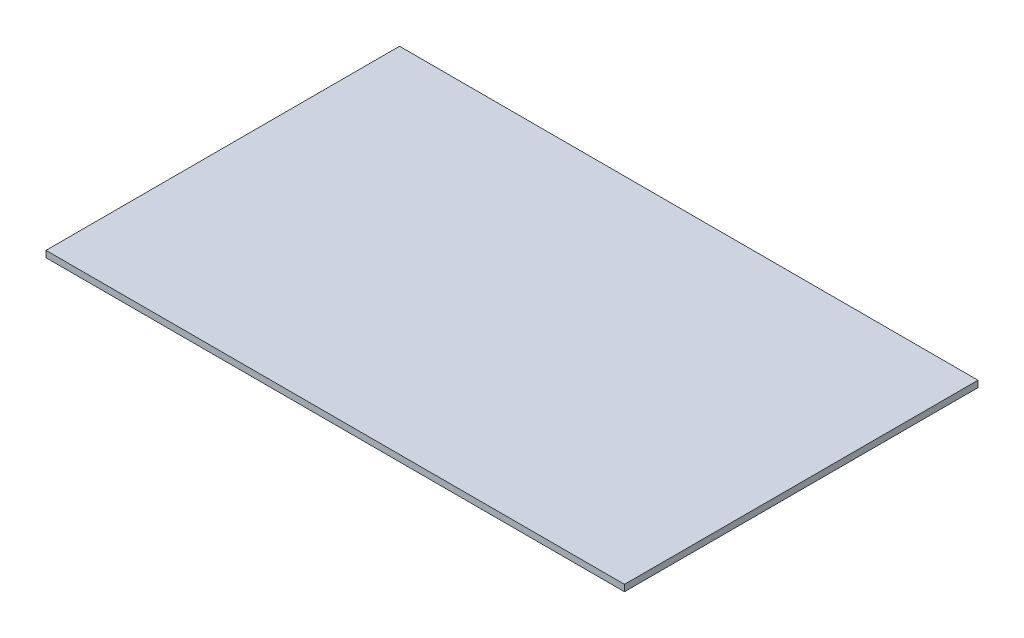
ISO-10303-21;
HEADER;
FILE_DESCRIPTION(('STEP AP214'),'2;1');
FILE_NAME('part.step','',(''),(''),'','','');
FILE_SCHEMA(('AUTOMOTIVE_DESIGN { 1 0 10303 214 1 1 1 1 }'));
ENDSEC;
DATA;
#1=APPLICATION_CONTEXT('core data for automotive mechanical design processes');
#2=APPLICATION_PROTOCOL_DEFINITION('international standard','automotive_design',2000,#1);
#3=PRODUCT_CONTEXT('',#1,'mechanical');
#4=PRODUCT('Part','Part','',(#3));
#5=PRODUCT_RELATED_PRODUCT_CATEGORY('part','',(#4));
#6=PRODUCT_DEFINITION_FORMATION('','',#4);
#7=PRODUCT_DEFINITION_CONTEXT('part definition',#1,'design');
#8=PRODUCT_DEFINITION('design','',#6,#7);
#9=PRODUCT_DEFINITION_SHAPE('','',#8);
#10=(LENGTH_UNIT() NAMED_UNIT(*) SI_UNIT(.MILLI.,.METRE.));
#11=(NAMED_UNIT(*) PLANE_ANGLE_UNIT() SI_UNIT($,.RADIAN.));
#12=(NAMED_UNIT(*) SI_UNIT($,.STERADIAN.) SOLID_ANGLE_UNIT());
#13=UNCERTAINTY_MEASURE_WITH_UNIT(LENGTH_MEASURE(1.E-05),#10,'distance_accuracy_value','');
#14=(GEOMETRIC_REPRESENTATION_CONTEXT(3) GLOBAL_UNCERTAINTY_ASSIGNED_CONTEXT((#13)) GLOBAL_UNIT_ASSIGNED_CONTEXT((#10,
#11,#12)) REPRESENTATION_CONTEXT('',''));
#15=CARTESIAN_POINT('',(0.,0.,0.));
#16=DIRECTION('',(0.,0.,1.));
#17=DIRECTION('',(1.,0.,0.));
#18=AXIS2_PLACEMENT_3D('',#15,#16,#17);
#19=CARTESIAN_POINT('',(0.,1.,0.));
#20=DIRECTION('',(1.,0.,0.));
#21=DIRECTION('',(0.,0.,-1.));
#22=AXIS2_PLACEMENT_3D('',#19,#20,#21);
#23=PLANE('',#22);
#24=DIRECTION('',(0.,0.,1.));
#25=VECTOR('',#24,1.);
#26=CARTESIAN_POINT('',(0.,0.,0.));
#27=LINE('',#26,#25);
#28=CARTESIAN_POINT('',(0.,0.,-55.));
#29=VERTEX_POINT('',#28);
#30=CARTESIAN_POINT('',(0.,0.,0.));
#31=VERTEX_POINT('',#30);
#32=EDGE_CURVE('E96',#29,#31,#27,.T.);
#33=ORIENTED_EDGE('',*,*,#32,.T.);
#34=DIRECTION('',(0.,-1.,0.));
#35=VECTOR('',#34,1.);
#36=CARTESIAN_POINT('',(0.,1.,0.));
#37=LINE('',#36,#35);
#38=CARTESIAN_POINT('',(0.,1.,0.));
#39=VERTEX_POINT('',#38);
#40=EDGE_CURVE('E11',#39,#31,#37,.T.);
#41=ORIENTED_EDGE('',*,*,#40,.F.);
#42=DIRECTION('',(0.,0.,1.));
#43=VECTOR('',#42,1.);
#44=CARTESIAN_POINT('',(0.,1.,0.));
#45=LINE('',#44,#43);
#46=CARTESIAN_POINT('',(0.,1.,-55.));
#47=VERTEX_POINT('',#46);
#48=EDGE_CURVE('E84',#47,#39,#45,.T.);
#49=ORIENTED_EDGE('',*,*,#48,.F.);
#50=DIRECTION('',(0.,-1.,0.));
#51=VECTOR('',#50,1.);
#52=CARTESIAN_POINT('',(0.,1.,-55.));
#53=LINE('',#52,#51);
#54=EDGE_CURVE('E92',#47,#29,#53,.T.);
#55=ORIENTED_EDGE('',*,*,#54,.T.);
#56=EDGE_LOOP('',(#33,#41,#49,#55));
#57=FACE_BOUND('',#56,.T.);
#58=ADVANCED_FACE('F33',(#57),#23,.F.);
#59=CARTESIAN_POINT('',(0.,1.,0.));
#60=DIRECTION('',(0.,0.,-1.));
#61=DIRECTION('',(-1.,0.,0.));
#62=AXIS2_PLACEMENT_3D('',#59,#60,#61);
#63=PLANE('',#62);
#64=DIRECTION('',(1.,0.,0.));
#65=VECTOR('',#64,1.);
#66=CARTESIAN_POINT('',(0.,0.,0.));
#67=LINE('',#66,#65);
#68=CARTESIAN_POINT('',(90.,0.,0.));
#69=VERTEX_POINT('',#68);
#70=EDGE_CURVE('E88',#31,#69,#67,.T.);
#71=ORIENTED_EDGE('',*,*,#70,.T.);
#72=DIRECTION('',(0.,-1.,0.));
#73=VECTOR('',#72,1.);
#74=CARTESIAN_POINT('',(90.,1.,0.));
#75=LINE('',#74,#73);
#76=CARTESIAN_POINT('',(90.,1.,0.));
#77=VERTEX_POINT('',#76);
#78=EDGE_CURVE('E41',#77,#69,#75,.T.);
#79=ORIENTED_EDGE('',*,*,#78,.F.);
#80=DIRECTION('',(1.,0.,0.));
#81=VECTOR('',#80,1.);
#82=CARTESIAN_POINT('',(0.,1.,0.));
#83=LINE('',#82,#81);
#84=EDGE_CURVE('E79',#39,#77,#83,.T.);
#85=ORIENTED_EDGE('',*,*,#84,.F.);
#86=ORIENTED_EDGE('',*,*,#40,.T.);
#87=EDGE_LOOP('',(#71,#79,#85,#86));
#88=FACE_BOUND('',#87,.T.);
#89=ADVANCED_FACE('F87',(#88),#63,.F.);
#90=CARTESIAN_POINT('',(90.,1.,0.));
#91=DIRECTION('',(-1.,0.,0.));
#92=DIRECTION('',(0.,0.,1.));
#93=AXIS2_PLACEMENT_3D('',#90,#91,#92);
#94=PLANE('',#93);
#95=DIRECTION('',(0.,0.,-1.));
#96=VECTOR('',#95,1.);
#97=CARTESIAN_POINT('',(90.,0.,0.));
#98=LINE('',#97,#96);
#99=CARTESIAN_POINT('',(90.,0.,-55.));
#100=VERTEX_POINT('',#99);
#101=EDGE_CURVE('E66',#69,#100,#98,.T.);
#102=ORIENTED_EDGE('',*,*,#101,.T.);
#103=DIRECTION('',(0.,-1.,0.));
#104=VECTOR('',#103,1.);
#105=CARTESIAN_POINT('',(90.,1.,-55.));
#106=LINE('',#105,#104);
#107=CARTESIAN_POINT('',(90.,1.,-55.));
#108=VERTEX_POINT('',#107);
#109=EDGE_CURVE('E89',#108,#100,#106,.T.);
#110=ORIENTED_EDGE('',*,*,#109,.F.);
#111=DIRECTION('',(0.,0.,-1.));
#112=VECTOR('',#111,1.);
#113=CARTESIAN_POINT('',(90.,1.,0.));
#114=LINE('',#113,#112);
#115=EDGE_CURVE('E82',#77,#108,#114,.T.);
#116=ORIENTED_EDGE('',*,*,#115,.F.);
#117=ORIENTED_EDGE('',*,*,#78,.T.);
#118=EDGE_LOOP('',(#102,#110,#116,#117));
#119=FACE_BOUND('',#118,.T.);
#120=ADVANCED_FACE('F90',(#119),#94,.F.);
#121=CARTESIAN_POINT('',(0.,1.,-55.));
#122=DIRECTION('',(0.,0.,1.));
#123=DIRECTION('',(1.,0.,0.));
#124=AXIS2_PLACEMENT_3D('',#121,#122,#123);
#125=PLANE('',#124);
#126=DIRECTION('',(-1.,0.,0.));
#127=VECTOR('',#126,1.);
#128=CARTESIAN_POINT('',(0.,0.,-55.));
#129=LINE('',#128,#127);
#130=EDGE_CURVE('E72',#100,#29,#129,.T.);
#131=ORIENTED_EDGE('',*,*,#130,.T.);
#132=ORIENTED_EDGE('',*,*,#54,.F.);
#133=DIRECTION('',(-1.,0.,0.));
#134=VECTOR('',#133,1.);
#135=CARTESIAN_POINT('',(0.,1.,-55.));
#136=LINE('',#135,#134);
#137=EDGE_CURVE('E49',#108,#47,#136,.T.);
#138=ORIENTED_EDGE('',*,*,#137,.F.);
#139=ORIENTED_EDGE('',*,*,#109,.T.);
#140=EDGE_LOOP('',(#131,#132,#138,#139));
#141=FACE_BOUND('',#140,.T.);
#142=ADVANCED_FACE('F103',(#141),#125,.F.);
#143=CARTESIAN_POINT('',(0.,1.,0.));
#144=DIRECTION('',(0.,-1.,0.));
#145=DIRECTION('',(0.,0.,-1.));
#146=AXIS2_PLACEMENT_3D('',#143,#144,#145);
#147=PLANE('',#146);
#148=ORIENTED_EDGE('',*,*,#48,.T.);
#149=ORIENTED_EDGE('',*,*,#84,.T.);
#150=ORIENTED_EDGE('',*,*,#115,.T.);
#151=ORIENTED_EDGE('',*,*,#137,.T.);
#152=EDGE_LOOP('',(#148,#149,#150,#151));
#153=FACE_BOUND('',#152,.T.);
#154=ADVANCED_FACE('F80',(#153),#147,.F.);
#155=CARTESIAN_POINT('',(0.,0.,0.));
#156=DIRECTION('',(0.,-1.,0.));
#157=DIRECTION('',(0.,0.,-1.));
#158=AXIS2_PLACEMENT_3D('',#155,#156,#157);
#159=PLANE('',#158);
#160=ORIENTED_EDGE('',*,*,#32,.F.);
#161=ORIENTED_EDGE('',*,*,#130,.F.);
#162=ORIENTED_EDGE('',*,*,#101,.F.);
#163=ORIENTED_EDGE('',*,*,#70,.F.);
#164=EDGE_LOOP('',(#160,#161,#162,#163));
#165=FACE_BOUND('',#164,.T.);
#166=ADVANCED_FACE('F106',(#165),#159,.T.);
#167=CLOSED_SHELL('',(#58,#89,#120,#142,#154,#166));
#168=MANIFOLD_SOLID_BREP('B2',#167);
#169=ADVANCED_BREP_SHAPE_REPRESENTATION('',(#18,#168),#14);
#170=SHAPE_DEFINITION_REPRESENTATION(#9,#169);
ENDSEC;
END-ISO-10303-21;
